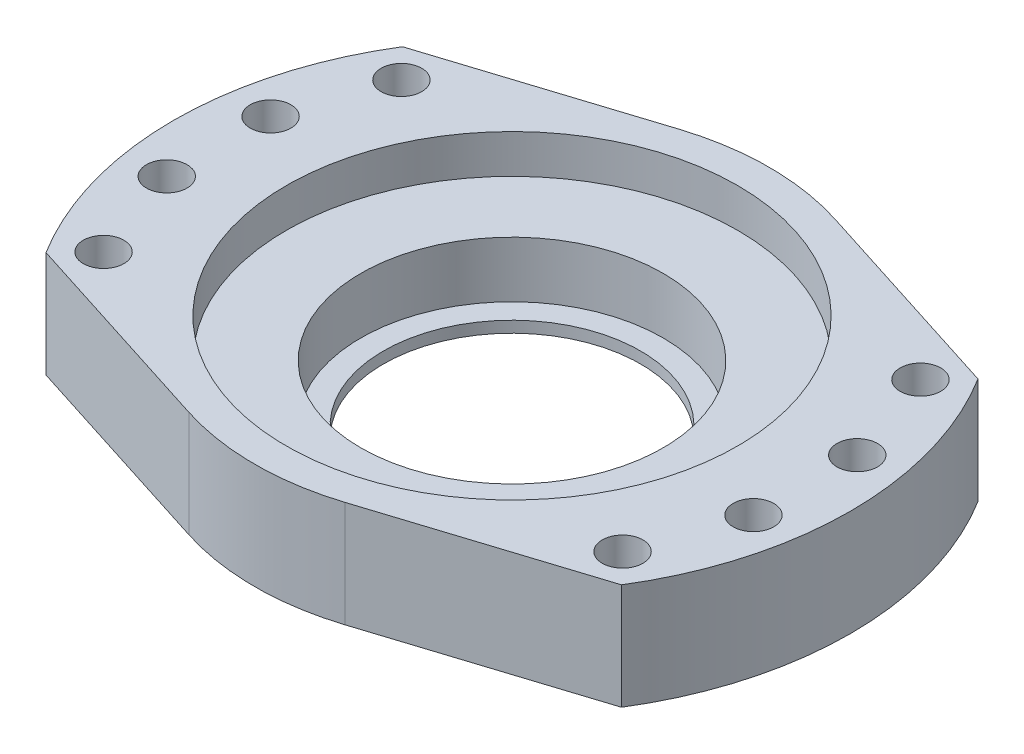
ISO-10303-21;
HEADER;
FILE_DESCRIPTION(('STEP AP214'),'2;1');
FILE_NAME('part.step','',(''),(''),'','','');
FILE_SCHEMA(('AUTOMOTIVE_DESIGN { 1 0 10303 214 1 1 1 1 }'));
ENDSEC;
DATA;
#1=APPLICATION_CONTEXT('core data for automotive mechanical design processes');
#2=APPLICATION_PROTOCOL_DEFINITION('international standard','automotive_design',2000,#1);
#3=PRODUCT_CONTEXT('',#1,'mechanical');
#4=PRODUCT('Part','Part','',(#3));
#5=PRODUCT_RELATED_PRODUCT_CATEGORY('part','',(#4));
#6=PRODUCT_DEFINITION_FORMATION('','',#4);
#7=PRODUCT_DEFINITION_CONTEXT('part definition',#1,'design');
#8=PRODUCT_DEFINITION('design','',#6,#7);
#9=PRODUCT_DEFINITION_SHAPE('','',#8);
#10=(LENGTH_UNIT() NAMED_UNIT(*) SI_UNIT(.MILLI.,.METRE.));
#11=(NAMED_UNIT(*) PLANE_ANGLE_UNIT() SI_UNIT($,.RADIAN.));
#12=(NAMED_UNIT(*) SI_UNIT($,.STERADIAN.) SOLID_ANGLE_UNIT());
#13=UNCERTAINTY_MEASURE_WITH_UNIT(LENGTH_MEASURE(1.E-05),#10,'distance_accuracy_value','');
#14=(GEOMETRIC_REPRESENTATION_CONTEXT(3) GLOBAL_UNCERTAINTY_ASSIGNED_CONTEXT((#13)) GLOBAL_UNIT_ASSIGNED_CONTEXT((#10,
#11,#12)) REPRESENTATION_CONTEXT('',''));
#15=CARTESIAN_POINT('',(0.,0.,0.));
#16=DIRECTION('',(0.,0.,1.));
#17=DIRECTION('',(1.,0.,0.));
#18=AXIS2_PLACEMENT_3D('',#15,#16,#17);
#19=CARTESIAN_POINT('',(0.,4.8,0.));
#20=DIRECTION('',(0.,-1.,0.));
#21=DIRECTION('',(0.,0.,-1.));
#22=AXIS2_PLACEMENT_3D('',#19,#20,#21);
#23=PLANE('',#22);
#24=CARTESIAN_POINT('',(0.,4.8,0.));
#25=DIRECTION('',(0.,-1.,0.));
#26=DIRECTION('',(0.,0.,-1.));
#27=AXIS2_PLACEMENT_3D('',#24,#25,#26);
#28=CIRCLE('',#27,67.);
#29=CARTESIAN_POINT('',(0.,4.8,-67.));
#30=VERTEX_POINT('',#29);
#31=EDGE_CURVE('E195',#30,#30,#28,.T.);
#32=ORIENTED_EDGE('',*,*,#31,.T.);
#33=EDGE_LOOP('',(#32));
#34=FACE_BOUND('',#33,.T.);
#35=CARTESIAN_POINT('',(0.,4.8,0.));
#36=DIRECTION('',(0.,-1.,0.));
#37=DIRECTION('',(0.,0.,-1.));
#38=AXIS2_PLACEMENT_3D('',#35,#36,#37);
#39=CIRCLE('',#38,100.);
#40=CARTESIAN_POINT('',(0.,4.8,-100.));
#41=VERTEX_POINT('',#40);
#42=EDGE_CURVE('E20',#41,#41,#39,.F.);
#43=ORIENTED_EDGE('',*,*,#42,.T.);
#44=EDGE_LOOP('',(#43));
#45=FACE_BOUND('',#44,.T.);
#46=ADVANCED_FACE('F17',(#34,#45),#23,.F.);
#47=CARTESIAN_POINT('',(0.,22.,0.));
#48=DIRECTION('',(0.,-1.,0.));
#49=DIRECTION('',(0.,0.,-1.));
#50=AXIS2_PLACEMENT_3D('',#47,#48,#49);
#51=CYLINDRICAL_SURFACE('',#50,100.);
#52=CARTESIAN_POINT('',(0.,22.,0.));
#53=DIRECTION('',(0.,-1.,0.));
#54=DIRECTION('',(0.,0.,-1.));
#55=AXIS2_PLACEMENT_3D('',#52,#53,#54);
#56=CIRCLE('',#55,100.);
#57=CARTESIAN_POINT('',(0.,22.,-100.));
#58=VERTEX_POINT('',#57);
#59=EDGE_CURVE('E193',#58,#58,#56,.T.);
#60=ORIENTED_EDGE('',*,*,#59,.F.);
#61=EDGE_LOOP('',(#60));
#62=FACE_BOUND('',#61,.T.);
#63=ORIENTED_EDGE('',*,*,#42,.F.);
#64=EDGE_LOOP('',(#63));
#65=FACE_BOUND('',#64,.T.);
#66=ADVANCED_FACE('F203',(#62,#65),#51,.F.);
#67=CARTESIAN_POINT('',(0.,4.8,0.));
#68=DIRECTION('',(0.,-1.,0.));
#69=DIRECTION('',(0.,0.,-1.));
#70=AXIS2_PLACEMENT_3D('',#67,#68,#69);
#71=CYLINDRICAL_SURFACE('',#70,67.);
#72=CARTESIAN_POINT('',(0.,-20.,0.));
#73=DIRECTION('',(0.,-1.,0.));
#74=DIRECTION('',(0.,0.,-1.));
#75=AXIS2_PLACEMENT_3D('',#72,#73,#74);
#76=CIRCLE('',#75,67.);
#77=CARTESIAN_POINT('',(0.,-20.,-67.));
#78=VERTEX_POINT('',#77);
#79=EDGE_CURVE('E91',#78,#78,#76,.T.);
#80=ORIENTED_EDGE('',*,*,#79,.T.);
#81=EDGE_LOOP('',(#80));
#82=FACE_BOUND('',#81,.T.);
#83=ORIENTED_EDGE('',*,*,#31,.F.);
#84=EDGE_LOOP('',(#83));
#85=FACE_BOUND('',#84,.T.);
#86=ADVANCED_FACE('F205',(#82,#85),#71,.F.);
#87=CARTESIAN_POINT('',(0.,22.,0.));
#88=DIRECTION('',(0.,1.,0.));
#89=DIRECTION('',(0.,0.,1.));
#90=AXIS2_PLACEMENT_3D('',#87,#88,#89);
#91=PLANE('',#90);
#92=CARTESIAN_POINT('',(-115.,22.,-66.));
#93=DIRECTION('',(0.,1.,0.));
#94=DIRECTION('',(0.,0.,1.));
#95=AXIS2_PLACEMENT_3D('',#92,#93,#94);
#96=CIRCLE('',#95,9.);
#97=CARTESIAN_POINT('',(-115.,22.,-57.));
#98=VERTEX_POINT('',#97);
#99=EDGE_CURVE('E160',#98,#98,#96,.F.);
#100=ORIENTED_EDGE('',*,*,#99,.T.);
#101=EDGE_LOOP('',(#100));
#102=FACE_BOUND('',#101,.T.);
#103=CARTESIAN_POINT('',(-130.,22.,-23.));
#104=DIRECTION('',(0.,1.,0.));
#105=DIRECTION('',(0.,0.,1.));
#106=AXIS2_PLACEMENT_3D('',#103,#104,#105);
#107=CIRCLE('',#106,9.);
#108=CARTESIAN_POINT('',(-130.,22.,-14.));
#109=VERTEX_POINT('',#108);
#110=EDGE_CURVE('E163',#109,#109,#107,.F.);
#111=ORIENTED_EDGE('',*,*,#110,.T.);
#112=EDGE_LOOP('',(#111));
#113=FACE_BOUND('',#112,.T.);
#114=CARTESIAN_POINT('',(115.,22.,-66.));
#115=DIRECTION('',(0.,1.,0.));
#116=DIRECTION('',(0.,0.,1.));
#117=AXIS2_PLACEMENT_3D('',#114,#115,#116);
#118=CIRCLE('',#117,9.);
#119=CARTESIAN_POINT('',(115.,22.,-57.));
#120=VERTEX_POINT('',#119);
#121=EDGE_CURVE('E166',#120,#120,#118,.F.);
#122=ORIENTED_EDGE('',*,*,#121,.T.);
#123=EDGE_LOOP('',(#122));
#124=FACE_BOUND('',#123,.T.);
#125=CARTESIAN_POINT('',(130.,22.,-23.));
#126=DIRECTION('',(0.,1.,0.));
#127=DIRECTION('',(0.,0.,1.));
#128=AXIS2_PLACEMENT_3D('',#125,#126,#127);
#129=CIRCLE('',#128,9.);
#130=CARTESIAN_POINT('',(130.,22.,-14.));
#131=VERTEX_POINT('',#130);
#132=EDGE_CURVE('E169',#131,#131,#129,.F.);
#133=ORIENTED_EDGE('',*,*,#132,.T.);
#134=EDGE_LOOP('',(#133));
#135=FACE_BOUND('',#134,.T.);
#136=CARTESIAN_POINT('',(-115.,22.,66.));
#137=DIRECTION('',(0.,1.,0.));
#138=DIRECTION('',(0.,0.,1.));
#139=AXIS2_PLACEMENT_3D('',#136,#137,#138);
#140=CIRCLE('',#139,9.);
#141=CARTESIAN_POINT('',(-115.,22.,75.));
#142=VERTEX_POINT('',#141);
#143=EDGE_CURVE('E172',#142,#142,#140,.F.);
#144=ORIENTED_EDGE('',*,*,#143,.T.);
#145=EDGE_LOOP('',(#144));
#146=FACE_BOUND('',#145,.T.);
#147=CARTESIAN_POINT('',(-130.,22.,23.));
#148=DIRECTION('',(0.,1.,0.));
#149=DIRECTION('',(0.,0.,1.));
#150=AXIS2_PLACEMENT_3D('',#147,#148,#149);
#151=CIRCLE('',#150,9.);
#152=CARTESIAN_POINT('',(-130.,22.,32.));
#153=VERTEX_POINT('',#152);
#154=EDGE_CURVE('E175',#153,#153,#151,.F.);
#155=ORIENTED_EDGE('',*,*,#154,.T.);
#156=EDGE_LOOP('',(#155));
#157=FACE_BOUND('',#156,.T.);
#158=CARTESIAN_POINT('',(115.,22.,66.));
#159=DIRECTION('',(0.,1.,0.));
#160=DIRECTION('',(0.,0.,1.));
#161=AXIS2_PLACEMENT_3D('',#158,#159,#160);
#162=CIRCLE('',#161,9.);
#163=CARTESIAN_POINT('',(115.,22.,75.));
#164=VERTEX_POINT('',#163);
#165=EDGE_CURVE('E178',#164,#164,#162,.F.);
#166=ORIENTED_EDGE('',*,*,#165,.T.);
#167=EDGE_LOOP('',(#166));
#168=FACE_BOUND('',#167,.T.);
#169=CARTESIAN_POINT('',(130.,22.,23.));
#170=DIRECTION('',(0.,1.,0.));
#171=DIRECTION('',(0.,0.,1.));
#172=AXIS2_PLACEMENT_3D('',#169,#170,#171);
#173=CIRCLE('',#172,9.);
#174=CARTESIAN_POINT('',(130.,22.,32.));
#175=VERTEX_POINT('',#174);
#176=EDGE_CURVE('E108',#175,#175,#173,.F.);
#177=ORIENTED_EDGE('',*,*,#176,.T.);
#178=EDGE_LOOP('',(#177));
#179=FACE_BOUND('',#178,.T.);
#180=ORIENTED_EDGE('',*,*,#59,.T.);
#181=EDGE_LOOP('',(#180));
#182=FACE_BOUND('',#181,.T.);
#183=DIRECTION('',(-0.952748002701292,0.,0.303761820097093));
#184=VECTOR('',#183,1.);
#185=CARTESIAN_POINT('',(-34.628847491,22.,-108.613272308));
#186=LINE('',#185,#184);
#187=CARTESIAN_POINT('',(-127.510783857822,22.,-78.9999999999666));
#188=VERTEX_POINT('',#187);
#189=CARTESIAN_POINT('',(-34.6288474910388,22.,-108.613272307988));
#190=VERTEX_POINT('',#189);
#191=EDGE_CURVE('E85',#188,#190,#186,.F.);
#192=ORIENTED_EDGE('',*,*,#191,.F.);
#193=CARTESIAN_POINT('',(0.,22.,0.));
#194=DIRECTION('',(0.,1.,0.));
#195=DIRECTION('',(0.,0.,1.));
#196=AXIS2_PLACEMENT_3D('',#193,#194,#195);
#197=CIRCLE('',#196,150.);
#198=CARTESIAN_POINT('',(-127.510783857801,22.,79.0000000000636));
#199=VERTEX_POINT('',#198);
#200=EDGE_CURVE('E80',#199,#188,#197,.F.);
#201=ORIENTED_EDGE('',*,*,#200,.F.);
#202=DIRECTION('',(0.952748002701292,0.,0.303761820097093));
#203=VECTOR('',#202,1.);
#204=CARTESIAN_POINT('',(-127.510783858,22.,79.));
#205=LINE('',#204,#203);
#206=CARTESIAN_POINT('',(-34.6288474910474,22.,108.613272308015));
#207=VERTEX_POINT('',#206);
#208=EDGE_CURVE('E83',#207,#199,#205,.F.);
#209=ORIENTED_EDGE('',*,*,#208,.F.);
#210=CARTESIAN_POINT('',(0.,22.,0.));
#211=DIRECTION('',(0.,1.,0.));
#212=DIRECTION('',(0.,0.,1.));
#213=AXIS2_PLACEMENT_3D('',#210,#211,#212);
#214=CIRCLE('',#213,114.);
#215=CARTESIAN_POINT('',(34.6288474910388,22.,108.613272307988));
#216=VERTEX_POINT('',#215);
#217=EDGE_CURVE('E189',#216,#207,#214,.F.);
#218=ORIENTED_EDGE('',*,*,#217,.F.);
#219=DIRECTION('',(0.952748002701292,0.,-0.303761820097093));
#220=VECTOR('',#219,1.);
#221=CARTESIAN_POINT('',(34.628847491,22.,108.613272308));
#222=LINE('',#221,#220);
#223=CARTESIAN_POINT('',(127.51078385772,22.,78.9999999999358));
#224=VERTEX_POINT('',#223);
#225=EDGE_CURVE('E115',#224,#216,#222,.F.);
#226=ORIENTED_EDGE('',*,*,#225,.F.);
#227=CARTESIAN_POINT('',(0.,22.,0.));
#228=DIRECTION('',(0.,1.,0.));
#229=DIRECTION('',(0.,0.,1.));
#230=AXIS2_PLACEMENT_3D('',#227,#228,#229);
#231=CIRCLE('',#230,150.);
#232=CARTESIAN_POINT('',(127.510783857801,22.,-79.0000000000636));
#233=VERTEX_POINT('',#232);
#234=EDGE_CURVE('E186',#233,#224,#231,.F.);
#235=ORIENTED_EDGE('',*,*,#234,.F.);
#236=DIRECTION('',(-0.952748002701292,0.,-0.303761820097093));
#237=VECTOR('',#236,1.);
#238=CARTESIAN_POINT('',(127.510783858,22.,-79.));
#239=LINE('',#238,#237);
#240=CARTESIAN_POINT('',(34.6288474910473,22.,-108.613272308015));
#241=VERTEX_POINT('',#240);
#242=EDGE_CURVE('E110',#241,#233,#239,.F.);
#243=ORIENTED_EDGE('',*,*,#242,.F.);
#244=CARTESIAN_POINT('',(0.,22.,0.));
#245=DIRECTION('',(0.,1.,0.));
#246=DIRECTION('',(0.,0.,1.));
#247=AXIS2_PLACEMENT_3D('',#244,#245,#246);
#248=CIRCLE('',#247,114.);
#249=EDGE_CURVE('E183',#190,#241,#248,.F.);
#250=ORIENTED_EDGE('',*,*,#249,.F.);
#251=EDGE_LOOP('',(#192,#201,#209,#218,#226,#235,#243,#250));
#252=FACE_BOUND('',#251,.T.);
#253=ADVANCED_FACE('F82',(#102,#113,#124,#135,#146,#157,#168,#179,#182,#252),#91,.T.);
#254=CARTESIAN_POINT('',(0.,-20.,0.));
#255=DIRECTION('',(0.,-1.,0.));
#256=DIRECTION('',(0.,0.,-1.));
#257=AXIS2_PLACEMENT_3D('',#254,#255,#256);
#258=PLANE('',#257);
#259=CARTESIAN_POINT('',(0.,-20.,0.));
#260=DIRECTION('',(0.,1.,0.));
#261=DIRECTION('',(0.,0.,1.));
#262=AXIS2_PLACEMENT_3D('',#259,#260,#261);
#263=CIRCLE('',#262,57.);
#264=CARTESIAN_POINT('',(0.,-20.,57.));
#265=VERTEX_POINT('',#264);
#266=EDGE_CURVE('E157',#265,#265,#263,.F.);
#267=ORIENTED_EDGE('',*,*,#266,.T.);
#268=EDGE_LOOP('',(#267));
#269=FACE_BOUND('',#268,.T.);
#270=ORIENTED_EDGE('',*,*,#79,.F.);
#271=EDGE_LOOP('',(#270));
#272=FACE_BOUND('',#271,.T.);
#273=ADVANCED_FACE('F287',(#269,#272),#258,.F.);
#274=CARTESIAN_POINT('',(0.,-25.,0.));
#275=DIRECTION('',(0.,1.,0.));
#276=DIRECTION('',(0.,0.,1.));
#277=AXIS2_PLACEMENT_3D('',#274,#275,#276);
#278=CYLINDRICAL_SURFACE('',#277,150.);
#279=DIRECTION('',(0.,1.,0.));
#280=VECTOR('',#279,1.);
#281=CARTESIAN_POINT('',(-127.510783858,-25.,79.));
#282=LINE('',#281,#280);
#283=CARTESIAN_POINT('',(-127.510783857801,-25.,79.0000000000636));
#284=VERTEX_POINT('',#283);
#285=EDGE_CURVE('E90',#199,#284,#282,.F.);
#286=ORIENTED_EDGE('',*,*,#285,.F.);
#287=ORIENTED_EDGE('',*,*,#200,.T.);
#288=DIRECTION('',(0.,1.,0.));
#289=VECTOR('',#288,1.);
#290=CARTESIAN_POINT('',(-127.510783857974,-25.,-78.9999999999182));
#291=LINE('',#290,#289);
#292=CARTESIAN_POINT('',(-127.510783857788,-25.,-79.0000000000227));
#293=VERTEX_POINT('',#292);
#294=EDGE_CURVE('E109',#293,#188,#291,.T.);
#295=ORIENTED_EDGE('',*,*,#294,.F.);
#296=CARTESIAN_POINT('',(0.,-25.,0.));
#297=DIRECTION('',(0.,1.,0.));
#298=DIRECTION('',(0.,0.,1.));
#299=AXIS2_PLACEMENT_3D('',#296,#297,#298);
#300=CIRCLE('',#299,150.);
#301=EDGE_CURVE('E102',#293,#284,#300,.T.);
#302=ORIENTED_EDGE('',*,*,#301,.T.);
#303=EDGE_LOOP('',(#286,#287,#295,#302));
#304=FACE_BOUND('',#303,.T.);
#305=ADVANCED_FACE('F101',(#304),#278,.T.);
#306=CARTESIAN_POINT('',(-127.510783858,-25.,79.));
#307=DIRECTION('',(-0.303761820097093,0.,0.952748002701292));
#308=DIRECTION('',(0.952748002701292,0.,0.303761820097093));
#309=AXIS2_PLACEMENT_3D('',#306,#307,#308);
#310=PLANE('',#309);
#311=DIRECTION('',(0.,1.,0.));
#312=VECTOR('',#311,1.);
#313=CARTESIAN_POINT('',(-34.6288474909912,-25.,108.613272307972));
#314=LINE('',#313,#312);
#315=CARTESIAN_POINT('',(-34.6288474909865,-25.,108.613272307989));
#316=VERTEX_POINT('',#315);
#317=EDGE_CURVE('E98',#207,#316,#314,.F.);
#318=ORIENTED_EDGE('',*,*,#317,.F.);
#319=ORIENTED_EDGE('',*,*,#208,.T.);
#320=ORIENTED_EDGE('',*,*,#285,.T.);
#321=DIRECTION('',(0.952748002701559,0.,0.303761820096254));
#322=VECTOR('',#321,1.);
#323=CARTESIAN_POINT('',(-127.510783858,-25.,79.));
#324=LINE('',#323,#322);
#325=EDGE_CURVE('E155',#284,#316,#324,.T.);
#326=ORIENTED_EDGE('',*,*,#325,.T.);
#327=EDGE_LOOP('',(#318,#319,#320,#326));
#328=FACE_BOUND('',#327,.T.);
#329=ADVANCED_FACE('F95',(#328),#310,.T.);
#330=CARTESIAN_POINT('',(0.,-25.,0.));
#331=DIRECTION('',(0.,1.,0.));
#332=DIRECTION('',(0.,0.,1.));
#333=AXIS2_PLACEMENT_3D('',#330,#331,#332);
#334=CYLINDRICAL_SURFACE('',#333,114.);
#335=DIRECTION('',(0.,1.,0.));
#336=VECTOR('',#335,1.);
#337=CARTESIAN_POINT('',(34.628847491,-25.,108.613272308));
#338=LINE('',#337,#336);
#339=CARTESIAN_POINT('',(34.628847490991,-25.,108.613272308003));
#340=VERTEX_POINT('',#339);
#341=EDGE_CURVE('E118',#216,#340,#338,.F.);
#342=ORIENTED_EDGE('',*,*,#341,.F.);
#343=ORIENTED_EDGE('',*,*,#217,.T.);
#344=ORIENTED_EDGE('',*,*,#317,.T.);
#345=CARTESIAN_POINT('',(0.,-25.,0.));
#346=DIRECTION('',(0.,1.,0.));
#347=DIRECTION('',(0.,0.,1.));
#348=AXIS2_PLACEMENT_3D('',#345,#346,#347);
#349=CIRCLE('',#348,114.);
#350=EDGE_CURVE('E152',#316,#340,#349,.T.);
#351=ORIENTED_EDGE('',*,*,#350,.T.);
#352=EDGE_LOOP('',(#342,#343,#344,#351));
#353=FACE_BOUND('',#352,.T.);
#354=ADVANCED_FACE('F278',(#353),#334,.T.);
#355=CARTESIAN_POINT('',(34.628847491,-25.,108.613272308));
#356=DIRECTION('',(0.303761820097093,0.,0.952748002701292));
#357=DIRECTION('',(0.952748002701292,0.,-0.303761820097093));
#358=AXIS2_PLACEMENT_3D('',#355,#356,#357);
#359=PLANE('',#358);
#360=DIRECTION('',(0.,1.,0.));
#361=VECTOR('',#360,1.);
#362=CARTESIAN_POINT('',(127.510783857769,-25.,78.9999999998568));
#363=LINE('',#362,#361);
#364=CARTESIAN_POINT('',(127.510783857685,-25.,78.9999999999919));
#365=VERTEX_POINT('',#364);
#366=EDGE_CURVE('E117',#224,#365,#363,.F.);
#367=ORIENTED_EDGE('',*,*,#366,.F.);
#368=ORIENTED_EDGE('',*,*,#225,.T.);
#369=ORIENTED_EDGE('',*,*,#341,.T.);
#370=DIRECTION('',(0.952748002701559,0.,-0.303761820096254));
#371=VECTOR('',#370,1.);
#372=CARTESIAN_POINT('',(34.628847491,-25.,108.613272308));
#373=LINE('',#372,#371);
#374=EDGE_CURVE('E151',#340,#365,#373,.T.);
#375=ORIENTED_EDGE('',*,*,#374,.T.);
#376=EDGE_LOOP('',(#367,#368,#369,#375));
#377=FACE_BOUND('',#376,.T.);
#378=ADVANCED_FACE('F274',(#377),#359,.T.);
#379=CARTESIAN_POINT('',(0.,-25.,0.));
#380=DIRECTION('',(0.,1.,0.));
#381=DIRECTION('',(0.,0.,1.));
#382=AXIS2_PLACEMENT_3D('',#379,#380,#381);
#383=CYLINDRICAL_SURFACE('',#382,150.);
#384=DIRECTION('',(0.,1.,0.));
#385=VECTOR('',#384,1.);
#386=CARTESIAN_POINT('',(127.510783858,-25.,-79.));
#387=LINE('',#386,#385);
#388=CARTESIAN_POINT('',(127.510783857801,-25.,-79.0000000000636));
#389=VERTEX_POINT('',#388);
#390=EDGE_CURVE('E114',#233,#389,#387,.F.);
#391=ORIENTED_EDGE('',*,*,#390,.F.);
#392=ORIENTED_EDGE('',*,*,#234,.T.);
#393=ORIENTED_EDGE('',*,*,#366,.T.);
#394=CARTESIAN_POINT('',(0.,-25.,0.));
#395=DIRECTION('',(0.,1.,0.));
#396=DIRECTION('',(0.,0.,1.));
#397=AXIS2_PLACEMENT_3D('',#394,#395,#396);
#398=CIRCLE('',#397,150.);
#399=EDGE_CURVE('E148',#365,#389,#398,.T.);
#400=ORIENTED_EDGE('',*,*,#399,.T.);
#401=EDGE_LOOP('',(#391,#392,#393,#400));
#402=FACE_BOUND('',#401,.T.);
#403=ADVANCED_FACE('F270',(#402),#383,.T.);
#404=CARTESIAN_POINT('',(127.510783858,-25.,-79.));
#405=DIRECTION('',(0.303761820097093,0.,-0.952748002701292));
#406=DIRECTION('',(-0.952748002701292,0.,-0.303761820097093));
#407=AXIS2_PLACEMENT_3D('',#404,#405,#406);
#408=PLANE('',#407);
#409=DIRECTION('',(0.,1.,0.));
#410=VECTOR('',#409,1.);
#411=CARTESIAN_POINT('',(34.6288474909911,-25.,-108.613272307972));
#412=LINE('',#411,#410);
#413=CARTESIAN_POINT('',(34.6288474909865,-25.,-108.613272307989));
#414=VERTEX_POINT('',#413);
#415=EDGE_CURVE('E113',#241,#414,#412,.F.);
#416=ORIENTED_EDGE('',*,*,#415,.F.);
#417=ORIENTED_EDGE('',*,*,#242,.T.);
#418=ORIENTED_EDGE('',*,*,#390,.T.);
#419=DIRECTION('',(-0.952748002701559,0.,-0.303761820096254));
#420=VECTOR('',#419,1.);
#421=CARTESIAN_POINT('',(127.510783858,-25.,-79.));
#422=LINE('',#421,#420);
#423=EDGE_CURVE('E147',#389,#414,#422,.T.);
#424=ORIENTED_EDGE('',*,*,#423,.T.);
#425=EDGE_LOOP('',(#416,#417,#418,#424));
#426=FACE_BOUND('',#425,.T.);
#427=ADVANCED_FACE('F266',(#426),#408,.T.);
#428=CARTESIAN_POINT('',(0.,-25.,0.));
#429=DIRECTION('',(0.,1.,0.));
#430=DIRECTION('',(0.,0.,1.));
#431=AXIS2_PLACEMENT_3D('',#428,#429,#430);
#432=CYLINDRICAL_SURFACE('',#431,114.);
#433=DIRECTION('',(0.,1.,0.));
#434=VECTOR('',#433,1.);
#435=CARTESIAN_POINT('',(-34.628847491,-25.,-108.613272308));
#436=LINE('',#435,#434);
#437=CARTESIAN_POINT('',(-34.628847490991,-25.,-108.613272308003));
#438=VERTEX_POINT('',#437);
#439=EDGE_CURVE('E35',#190,#438,#436,.F.);
#440=ORIENTED_EDGE('',*,*,#439,.F.);
#441=ORIENTED_EDGE('',*,*,#249,.T.);
#442=ORIENTED_EDGE('',*,*,#415,.T.);
#443=CARTESIAN_POINT('',(0.,-25.,0.));
#444=DIRECTION('',(0.,1.,0.));
#445=DIRECTION('',(0.,0.,1.));
#446=AXIS2_PLACEMENT_3D('',#443,#444,#445);
#447=CIRCLE('',#446,114.);
#448=EDGE_CURVE('E144',#414,#438,#447,.T.);
#449=ORIENTED_EDGE('',*,*,#448,.T.);
#450=EDGE_LOOP('',(#440,#441,#442,#449));
#451=FACE_BOUND('',#450,.T.);
#452=ADVANCED_FACE('F263',(#451),#432,.T.);
#453=CARTESIAN_POINT('',(-34.628847491,-25.,-108.613272308));
#454=DIRECTION('',(-0.303761820097093,0.,-0.952748002701292));
#455=DIRECTION('',(-0.952748002701292,0.,0.303761820097093));
#456=AXIS2_PLACEMENT_3D('',#453,#454,#455);
#457=PLANE('',#456);
#458=ORIENTED_EDGE('',*,*,#294,.T.);
#459=ORIENTED_EDGE('',*,*,#191,.T.);
#460=ORIENTED_EDGE('',*,*,#439,.T.);
#461=DIRECTION('',(-0.952748002701559,0.,0.303761820096254));
#462=VECTOR('',#461,1.);
#463=CARTESIAN_POINT('',(-34.628847491,-25.,-108.613272308));
#464=LINE('',#463,#462);
#465=EDGE_CURVE('E143',#438,#293,#464,.T.);
#466=ORIENTED_EDGE('',*,*,#465,.T.);
#467=EDGE_LOOP('',(#458,#459,#460,#466));
#468=FACE_BOUND('',#467,.T.);
#469=ADVANCED_FACE('F259',(#468),#457,.T.);
#470=CARTESIAN_POINT('',(130.,22.,23.));
#471=DIRECTION('',(0.,1.,0.));
#472=DIRECTION('',(0.,0.,1.));
#473=AXIS2_PLACEMENT_3D('',#470,#471,#472);
#474=CYLINDRICAL_SURFACE('',#473,9.);
#475=ORIENTED_EDGE('',*,*,#176,.F.);
#476=EDGE_LOOP('',(#475));
#477=FACE_BOUND('',#476,.T.);
#478=CARTESIAN_POINT('',(130.,-25.,23.));
#479=DIRECTION('',(0.,1.,0.));
#480=DIRECTION('',(0.,0.,1.));
#481=AXIS2_PLACEMENT_3D('',#478,#479,#480);
#482=CIRCLE('',#481,9.);
#483=CARTESIAN_POINT('',(130.,-25.,32.));
#484=VERTEX_POINT('',#483);
#485=EDGE_CURVE('E140',#484,#484,#482,.F.);
#486=ORIENTED_EDGE('',*,*,#485,.T.);
#487=EDGE_LOOP('',(#486));
#488=FACE_BOUND('',#487,.T.);
#489=ADVANCED_FACE('F255',(#477,#488),#474,.F.);
#490=CARTESIAN_POINT('',(115.,22.,66.));
#491=DIRECTION('',(0.,1.,0.));
#492=DIRECTION('',(0.,0.,1.));
#493=AXIS2_PLACEMENT_3D('',#490,#491,#492);
#494=CYLINDRICAL_SURFACE('',#493,9.);
#495=ORIENTED_EDGE('',*,*,#165,.F.);
#496=EDGE_LOOP('',(#495));
#497=FACE_BOUND('',#496,.T.);
#498=CARTESIAN_POINT('',(115.,-25.,66.));
#499=DIRECTION('',(0.,1.,0.));
#500=DIRECTION('',(0.,0.,1.));
#501=AXIS2_PLACEMENT_3D('',#498,#499,#500);
#502=CIRCLE('',#501,9.);
#503=CARTESIAN_POINT('',(115.,-25.,75.));
#504=VERTEX_POINT('',#503);
#505=EDGE_CURVE('E137',#504,#504,#502,.F.);
#506=ORIENTED_EDGE('',*,*,#505,.T.);
#507=EDGE_LOOP('',(#506));
#508=FACE_BOUND('',#507,.T.);
#509=ADVANCED_FACE('F251',(#497,#508),#494,.F.);
#510=CARTESIAN_POINT('',(-130.,22.,23.));
#511=DIRECTION('',(0.,1.,0.));
#512=DIRECTION('',(0.,0.,1.));
#513=AXIS2_PLACEMENT_3D('',#510,#511,#512);
#514=CYLINDRICAL_SURFACE('',#513,9.);
#515=ORIENTED_EDGE('',*,*,#154,.F.);
#516=EDGE_LOOP('',(#515));
#517=FACE_BOUND('',#516,.T.);
#518=CARTESIAN_POINT('',(-130.,-25.,23.));
#519=DIRECTION('',(0.,1.,0.));
#520=DIRECTION('',(0.,0.,1.));
#521=AXIS2_PLACEMENT_3D('',#518,#519,#520);
#522=CIRCLE('',#521,9.);
#523=CARTESIAN_POINT('',(-130.,-25.,32.));
#524=VERTEX_POINT('',#523);
#525=EDGE_CURVE('E134',#524,#524,#522,.F.);
#526=ORIENTED_EDGE('',*,*,#525,.T.);
#527=EDGE_LOOP('',(#526));
#528=FACE_BOUND('',#527,.T.);
#529=ADVANCED_FACE('F247',(#517,#528),#514,.F.);
#530=CARTESIAN_POINT('',(-115.,22.,66.));
#531=DIRECTION('',(0.,1.,0.));
#532=DIRECTION('',(0.,0.,1.));
#533=AXIS2_PLACEMENT_3D('',#530,#531,#532);
#534=CYLINDRICAL_SURFACE('',#533,9.);
#535=ORIENTED_EDGE('',*,*,#143,.F.);
#536=EDGE_LOOP('',(#535));
#537=FACE_BOUND('',#536,.T.);
#538=CARTESIAN_POINT('',(-115.,-25.,66.));
#539=DIRECTION('',(0.,1.,0.));
#540=DIRECTION('',(0.,0.,1.));
#541=AXIS2_PLACEMENT_3D('',#538,#539,#540);
#542=CIRCLE('',#541,9.);
#543=CARTESIAN_POINT('',(-115.,-25.,75.));
#544=VERTEX_POINT('',#543);
#545=EDGE_CURVE('E131',#544,#544,#542,.F.);
#546=ORIENTED_EDGE('',*,*,#545,.T.);
#547=EDGE_LOOP('',(#546));
#548=FACE_BOUND('',#547,.T.);
#549=ADVANCED_FACE('F243',(#537,#548),#534,.F.);
#550=CARTESIAN_POINT('',(130.,22.,-23.));
#551=DIRECTION('',(0.,1.,0.));
#552=DIRECTION('',(0.,0.,1.));
#553=AXIS2_PLACEMENT_3D('',#550,#551,#552);
#554=CYLINDRICAL_SURFACE('',#553,9.);
#555=ORIENTED_EDGE('',*,*,#132,.F.);
#556=EDGE_LOOP('',(#555));
#557=FACE_BOUND('',#556,.T.);
#558=CARTESIAN_POINT('',(130.,-25.,-23.));
#559=DIRECTION('',(0.,1.,0.));
#560=DIRECTION('',(0.,0.,1.));
#561=AXIS2_PLACEMENT_3D('',#558,#559,#560);
#562=CIRCLE('',#561,9.);
#563=CARTESIAN_POINT('',(130.,-25.,-14.));
#564=VERTEX_POINT('',#563);
#565=EDGE_CURVE('E128',#564,#564,#562,.F.);
#566=ORIENTED_EDGE('',*,*,#565,.T.);
#567=EDGE_LOOP('',(#566));
#568=FACE_BOUND('',#567,.T.);
#569=ADVANCED_FACE('F239',(#557,#568),#554,.F.);
#570=CARTESIAN_POINT('',(115.,22.,-66.));
#571=DIRECTION('',(0.,1.,0.));
#572=DIRECTION('',(0.,0.,1.));
#573=AXIS2_PLACEMENT_3D('',#570,#571,#572);
#574=CYLINDRICAL_SURFACE('',#573,9.);
#575=ORIENTED_EDGE('',*,*,#121,.F.);
#576=EDGE_LOOP('',(#575));
#577=FACE_BOUND('',#576,.T.);
#578=CARTESIAN_POINT('',(115.,-25.,-66.));
#579=DIRECTION('',(0.,1.,0.));
#580=DIRECTION('',(0.,0.,1.));
#581=AXIS2_PLACEMENT_3D('',#578,#579,#580);
#582=CIRCLE('',#581,9.);
#583=CARTESIAN_POINT('',(115.,-25.,-57.));
#584=VERTEX_POINT('',#583);
#585=EDGE_CURVE('E125',#584,#584,#582,.F.);
#586=ORIENTED_EDGE('',*,*,#585,.T.);
#587=EDGE_LOOP('',(#586));
#588=FACE_BOUND('',#587,.T.);
#589=ADVANCED_FACE('F235',(#577,#588),#574,.F.);
#590=CARTESIAN_POINT('',(-130.,22.,-23.));
#591=DIRECTION('',(0.,1.,0.));
#592=DIRECTION('',(0.,0.,1.));
#593=AXIS2_PLACEMENT_3D('',#590,#591,#592);
#594=CYLINDRICAL_SURFACE('',#593,9.);
#595=ORIENTED_EDGE('',*,*,#110,.F.);
#596=EDGE_LOOP('',(#595));
#597=FACE_BOUND('',#596,.T.);
#598=CARTESIAN_POINT('',(-130.,-25.,-23.));
#599=DIRECTION('',(0.,1.,0.));
#600=DIRECTION('',(0.,0.,1.));
#601=AXIS2_PLACEMENT_3D('',#598,#599,#600);
#602=CIRCLE('',#601,9.);
#603=CARTESIAN_POINT('',(-130.,-25.,-14.));
#604=VERTEX_POINT('',#603);
#605=EDGE_CURVE('E122',#604,#604,#602,.F.);
#606=ORIENTED_EDGE('',*,*,#605,.T.);
#607=EDGE_LOOP('',(#606));
#608=FACE_BOUND('',#607,.T.);
#609=ADVANCED_FACE('F231',(#597,#608),#594,.F.);
#610=CARTESIAN_POINT('',(-115.,22.,-66.));
#611=DIRECTION('',(0.,1.,0.));
#612=DIRECTION('',(0.,0.,1.));
#613=AXIS2_PLACEMENT_3D('',#610,#611,#612);
#614=CYLINDRICAL_SURFACE('',#613,9.);
#615=ORIENTED_EDGE('',*,*,#99,.F.);
#616=EDGE_LOOP('',(#615));
#617=FACE_BOUND('',#616,.T.);
#618=CARTESIAN_POINT('',(-115.,-25.,-66.));
#619=DIRECTION('',(0.,1.,0.));
#620=DIRECTION('',(0.,0.,1.));
#621=AXIS2_PLACEMENT_3D('',#618,#619,#620);
#622=CIRCLE('',#621,9.);
#623=CARTESIAN_POINT('',(-115.,-25.,-57.));
#624=VERTEX_POINT('',#623);
#625=EDGE_CURVE('E26',#624,#624,#622,.F.);
#626=ORIENTED_EDGE('',*,*,#625,.T.);
#627=EDGE_LOOP('',(#626));
#628=FACE_BOUND('',#627,.T.);
#629=ADVANCED_FACE('F223',(#617,#628),#614,.F.);
#630=CARTESIAN_POINT('',(0.,-89.7732050808,0.));
#631=DIRECTION('',(0.,1.,0.));
#632=DIRECTION('',(0.,0.,1.));
#633=AXIS2_PLACEMENT_3D('',#630,#631,#632);
#634=CYLINDRICAL_SURFACE('',#633,57.);
#635=ORIENTED_EDGE('',*,*,#266,.F.);
#636=EDGE_LOOP('',(#635));
#637=FACE_BOUND('',#636,.T.);
#638=CARTESIAN_POINT('',(0.,-25.,0.));
#639=DIRECTION('',(0.,1.,0.));
#640=DIRECTION('',(0.,0.,1.));
#641=AXIS2_PLACEMENT_3D('',#638,#639,#640);
#642=CIRCLE('',#641,57.);
#643=CARTESIAN_POINT('',(0.,-25.,57.));
#644=VERTEX_POINT('',#643);
#645=EDGE_CURVE('E11',#644,#644,#642,.F.);
#646=ORIENTED_EDGE('',*,*,#645,.T.);
#647=EDGE_LOOP('',(#646));
#648=FACE_BOUND('',#647,.T.);
#649=ADVANCED_FACE('F217',(#637,#648),#634,.F.);
#650=CARTESIAN_POINT('',(0.,-25.,0.));
#651=DIRECTION('',(0.,1.,0.));
#652=DIRECTION('',(0.,0.,1.));
#653=AXIS2_PLACEMENT_3D('',#650,#651,#652);
#654=PLANE('',#653);
#655=ORIENTED_EDGE('',*,*,#645,.F.);
#656=EDGE_LOOP('',(#655));
#657=FACE_BOUND('',#656,.T.);
#658=ORIENTED_EDGE('',*,*,#625,.F.);
#659=EDGE_LOOP('',(#658));
#660=FACE_BOUND('',#659,.T.);
#661=ORIENTED_EDGE('',*,*,#605,.F.);
#662=EDGE_LOOP('',(#661));
#663=FACE_BOUND('',#662,.T.);
#664=ORIENTED_EDGE('',*,*,#585,.F.);
#665=EDGE_LOOP('',(#664));
#666=FACE_BOUND('',#665,.T.);
#667=ORIENTED_EDGE('',*,*,#565,.F.);
#668=EDGE_LOOP('',(#667));
#669=FACE_BOUND('',#668,.T.);
#670=ORIENTED_EDGE('',*,*,#545,.F.);
#671=EDGE_LOOP('',(#670));
#672=FACE_BOUND('',#671,.T.);
#673=ORIENTED_EDGE('',*,*,#525,.F.);
#674=EDGE_LOOP('',(#673));
#675=FACE_BOUND('',#674,.T.);
#676=ORIENTED_EDGE('',*,*,#505,.F.);
#677=EDGE_LOOP('',(#676));
#678=FACE_BOUND('',#677,.T.);
#679=ORIENTED_EDGE('',*,*,#485,.F.);
#680=EDGE_LOOP('',(#679));
#681=FACE_BOUND('',#680,.T.);
#682=ORIENTED_EDGE('',*,*,#448,.F.);
#683=ORIENTED_EDGE('',*,*,#423,.F.);
#684=ORIENTED_EDGE('',*,*,#399,.F.);
#685=ORIENTED_EDGE('',*,*,#374,.F.);
#686=ORIENTED_EDGE('',*,*,#350,.F.);
#687=ORIENTED_EDGE('',*,*,#325,.F.);
#688=ORIENTED_EDGE('',*,*,#301,.F.);
#689=ORIENTED_EDGE('',*,*,#465,.F.);
#690=EDGE_LOOP('',(#682,#683,#684,#685,#686,#687,#688,#689));
#691=FACE_BOUND('',#690,.T.);
#692=ADVANCED_FACE('F215',(#657,#660,#663,#666,#669,#672,#675,#678,#681,#691),#654,.F.);
#693=CLOSED_SHELL('',(#46,#66,#86,#253,#273,#305,#329,#354,#378,#403,#427,#452,#469,#489,#509,
#529,#549,#569,#589,#609,#629,#649,#692));
#694=MANIFOLD_SOLID_BREP('B1',#693);
#695=ADVANCED_BREP_SHAPE_REPRESENTATION('',(#18,#694),#14);
#696=SHAPE_DEFINITION_REPRESENTATION(#9,#695);
ENDSEC;
END-ISO-10303-21;
